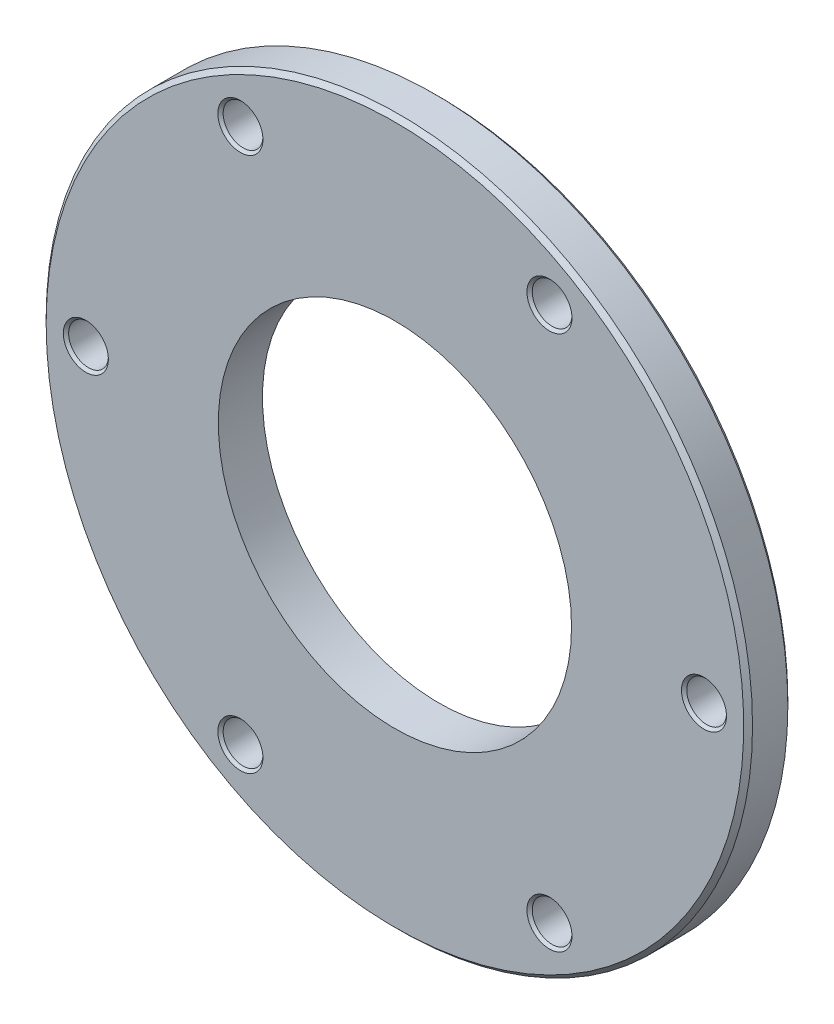
ISO-10303-21;
HEADER;
FILE_DESCRIPTION(('STEP AP214'),'2;1');
FILE_NAME('part.step','',(''),(''),'','','');
FILE_SCHEMA(('AUTOMOTIVE_DESIGN { 1 0 10303 214 1 1 1 1 }'));
ENDSEC;
DATA;
#1=APPLICATION_CONTEXT('core data for automotive mechanical design processes');
#2=APPLICATION_PROTOCOL_DEFINITION('international standard','automotive_design',2000,#1);
#3=PRODUCT_CONTEXT('',#1,'mechanical');
#4=PRODUCT('Part','Part','',(#3));
#5=PRODUCT_RELATED_PRODUCT_CATEGORY('part','',(#4));
#6=PRODUCT_DEFINITION_FORMATION('','',#4);
#7=PRODUCT_DEFINITION_CONTEXT('part definition',#1,'design');
#8=PRODUCT_DEFINITION('design','',#6,#7);
#9=PRODUCT_DEFINITION_SHAPE('','',#8);
#10=(LENGTH_UNIT() NAMED_UNIT(*) SI_UNIT(.MILLI.,.METRE.));
#11=(NAMED_UNIT(*) PLANE_ANGLE_UNIT() SI_UNIT($,.RADIAN.));
#12=(NAMED_UNIT(*) SI_UNIT($,.STERADIAN.) SOLID_ANGLE_UNIT());
#13=UNCERTAINTY_MEASURE_WITH_UNIT(LENGTH_MEASURE(1.E-05),#10,'distance_accuracy_value','');
#14=(GEOMETRIC_REPRESENTATION_CONTEXT(3) GLOBAL_UNCERTAINTY_ASSIGNED_CONTEXT((#13)) GLOBAL_UNIT_ASSIGNED_CONTEXT((#10,
#11,#12)) REPRESENTATION_CONTEXT('',''));
#15=CARTESIAN_POINT('',(0.,0.,0.));
#16=DIRECTION('',(0.,0.,1.));
#17=DIRECTION('',(1.,0.,0.));
#18=AXIS2_PLACEMENT_3D('',#15,#16,#17);
#19=CARTESIAN_POINT('',(17.5,-30.3108891324554,-2.50000000005457));
#20=DIRECTION('',(0.,0.,-1.));
#21=DIRECTION('',(-1.,0.,0.));
#22=AXIS2_PLACEMENT_3D('',#19,#20,#21);
#23=CONICAL_SURFACE('',#22,2.55000000009716,0.785398163368351);
#24=CARTESIAN_POINT('',(17.5,-30.3108891324554,-2.49999999999773));
#25=DIRECTION('',(0.,0.,-1.));
#26=DIRECTION('',(-1.,0.,0.));
#27=AXIS2_PLACEMENT_3D('',#24,#25,#26);
#28=CIRCLE('',#27,2.55000000004032);
#29=CARTESIAN_POINT('',(14.9499999999597,-30.3108891324554,-2.49999999999773));
#30=VERTEX_POINT('',#29);
#31=EDGE_CURVE('E16',#30,#30,#28,.F.);
#32=ORIENTED_EDGE('',*,*,#31,.F.);
#33=EDGE_LOOP('',(#32));
#34=FACE_BOUND('',#33,.T.);
#35=CARTESIAN_POINT('',(17.5,-30.3108891324554,-2.2));
#36=DIRECTION('',(0.,0.,1.));
#37=DIRECTION('',(1.,0.,0.));
#38=AXIS2_PLACEMENT_3D('',#35,#36,#37);
#39=CIRCLE('',#38,2.25);
#40=CARTESIAN_POINT('',(19.75,-30.3108891324554,-2.2));
#41=VERTEX_POINT('',#40);
#42=EDGE_CURVE('E28',#41,#41,#39,.T.);
#43=ORIENTED_EDGE('',*,*,#42,.T.);
#44=EDGE_LOOP('',(#43));
#45=FACE_BOUND('',#44,.T.);
#46=ADVANCED_FACE('F13',(#34,#45),#23,.F.);
#47=CARTESIAN_POINT('',(-17.5,-30.3108891324553,-2.49999999988404));
#48=DIRECTION('',(0.,0.,-1.));
#49=DIRECTION('',(-1.,0.,0.));
#50=AXIS2_PLACEMENT_3D('',#47,#48,#49);
#51=CONICAL_SURFACE('',#50,2.55000000000539,0.785398163461389);
#52=CARTESIAN_POINT('',(-17.5,-30.3108891324553,-2.49999999996169));
#53=DIRECTION('',(0.,0.,-1.));
#54=DIRECTION('',(-1.,0.,0.));
#55=AXIS2_PLACEMENT_3D('',#52,#53,#54);
#56=CIRCLE('',#55,2.55000000008304);
#57=CARTESIAN_POINT('',(-20.050000000083,-30.3108891324553,-2.49999999996169));
#58=VERTEX_POINT('',#57);
#59=EDGE_CURVE('E67',#58,#58,#56,.F.);
#60=ORIENTED_EDGE('',*,*,#59,.F.);
#61=EDGE_LOOP('',(#60));
#62=FACE_BOUND('',#61,.T.);
#63=CARTESIAN_POINT('',(-17.5,-30.3108891324553,-2.2));
#64=DIRECTION('',(0.,0.,1.));
#65=DIRECTION('',(1.,0.,0.));
#66=AXIS2_PLACEMENT_3D('',#63,#64,#65);
#67=CIRCLE('',#66,2.25);
#68=CARTESIAN_POINT('',(-15.25,-30.3108891324553,-2.2));
#69=VERTEX_POINT('',#68);
#70=EDGE_CURVE('E93',#69,#69,#67,.T.);
#71=ORIENTED_EDGE('',*,*,#70,.T.);
#72=EDGE_LOOP('',(#71));
#73=FACE_BOUND('',#72,.T.);
#74=ADVANCED_FACE('F190',(#62,#73),#51,.F.);
#75=CARTESIAN_POINT('',(-35.,0.,-2.49999999988404));
#76=DIRECTION('',(0.,0.,-1.));
#77=DIRECTION('',(-1.,0.,0.));
#78=AXIS2_PLACEMENT_3D('',#75,#76,#77);
#79=CONICAL_SURFACE('',#78,2.5499999998965,0.785398163397448);
#80=CARTESIAN_POINT('',(-35.,0.,-2.49999999994088));
#81=DIRECTION('',(0.,0.,-1.));
#82=DIRECTION('',(-1.,0.,0.));
#83=AXIS2_PLACEMENT_3D('',#80,#81,#82);
#84=CIRCLE('',#83,2.54999999995334);
#85=CARTESIAN_POINT('',(-37.5499999999533,0.,-2.49999999994088));
#86=VERTEX_POINT('',#85);
#87=EDGE_CURVE('E65',#86,#86,#84,.F.);
#88=ORIENTED_EDGE('',*,*,#87,.F.);
#89=EDGE_LOOP('',(#88));
#90=FACE_BOUND('',#89,.T.);
#91=CARTESIAN_POINT('',(-35.,0.,-2.2));
#92=DIRECTION('',(0.,0.,1.));
#93=DIRECTION('',(1.,0.,0.));
#94=AXIS2_PLACEMENT_3D('',#91,#92,#93);
#95=CIRCLE('',#94,2.25);
#96=CARTESIAN_POINT('',(-32.75,0.,-2.2));
#97=VERTEX_POINT('',#96);
#98=EDGE_CURVE('E91',#97,#97,#95,.T.);
#99=ORIENTED_EDGE('',*,*,#98,.T.);
#100=EDGE_LOOP('',(#99));
#101=FACE_BOUND('',#100,.T.);
#102=ADVANCED_FACE('F187',(#90,#101),#79,.F.);
#103=CARTESIAN_POINT('',(-17.5,30.3108891324554,-2.50000000005457));
#104=DIRECTION('',(0.,0.,-1.));
#105=DIRECTION('',(-1.,0.,0.));
#106=AXIS2_PLACEMENT_3D('',#103,#104,#105);
#107=CONICAL_SURFACE('',#106,2.55000000009716,0.785398163368351);
#108=CARTESIAN_POINT('',(-17.5,30.3108891324554,-2.49999999999773));
#109=DIRECTION('',(0.,0.,-1.));
#110=DIRECTION('',(-1.,0.,0.));
#111=AXIS2_PLACEMENT_3D('',#108,#109,#110);
#112=CIRCLE('',#111,2.55000000004032);
#113=CARTESIAN_POINT('',(-20.0500000000403,30.3108891324554,-2.49999999999773));
#114=VERTEX_POINT('',#113);
#115=EDGE_CURVE('E62',#114,#114,#112,.F.);
#116=ORIENTED_EDGE('',*,*,#115,.F.);
#117=EDGE_LOOP('',(#116));
#118=FACE_BOUND('',#117,.T.);
#119=CARTESIAN_POINT('',(-17.5,30.3108891324554,-2.2));
#120=DIRECTION('',(0.,0.,1.));
#121=DIRECTION('',(1.,0.,0.));
#122=AXIS2_PLACEMENT_3D('',#119,#120,#121);
#123=CIRCLE('',#122,2.25);
#124=CARTESIAN_POINT('',(-15.25,30.3108891324554,-2.2));
#125=VERTEX_POINT('',#124);
#126=EDGE_CURVE('E88',#125,#125,#123,.T.);
#127=ORIENTED_EDGE('',*,*,#126,.T.);
#128=EDGE_LOOP('',(#127));
#129=FACE_BOUND('',#128,.T.);
#130=ADVANCED_FACE('F189',(#118,#129),#107,.F.);
#131=CARTESIAN_POINT('',(17.5,30.3108891324554,-2.50000000005457));
#132=DIRECTION('',(0.,0.,-1.));
#133=DIRECTION('',(-1.,0.,0.));
#134=AXIS2_PLACEMENT_3D('',#131,#132,#133);
#135=CONICAL_SURFACE('',#134,2.55000000009716,0.785398163368351);
#136=CARTESIAN_POINT('',(17.5,30.3108891324554,-2.49999999999773));
#137=DIRECTION('',(0.,0.,-1.));
#138=DIRECTION('',(-1.,0.,0.));
#139=AXIS2_PLACEMENT_3D('',#136,#137,#138);
#140=CIRCLE('',#139,2.55000000004032);
#141=CARTESIAN_POINT('',(14.9499999999597,30.3108891324554,-2.49999999999773));
#142=VERTEX_POINT('',#141);
#143=EDGE_CURVE('E59',#142,#142,#140,.F.);
#144=ORIENTED_EDGE('',*,*,#143,.F.);
#145=EDGE_LOOP('',(#144));
#146=FACE_BOUND('',#145,.T.);
#147=CARTESIAN_POINT('',(17.5,30.3108891324554,-2.2));
#148=DIRECTION('',(0.,0.,1.));
#149=DIRECTION('',(1.,0.,0.));
#150=AXIS2_PLACEMENT_3D('',#147,#148,#149);
#151=CIRCLE('',#150,2.25);
#152=CARTESIAN_POINT('',(19.75,30.3108891324554,-2.2));
#153=VERTEX_POINT('',#152);
#154=EDGE_CURVE('E81',#153,#153,#151,.T.);
#155=ORIENTED_EDGE('',*,*,#154,.T.);
#156=EDGE_LOOP('',(#155));
#157=FACE_BOUND('',#156,.T.);
#158=ADVANCED_FACE('F197',(#146,#157),#135,.F.);
#159=CARTESIAN_POINT('',(35.,0.,-2.49999999988404));
#160=DIRECTION('',(0.,0.,-1.));
#161=DIRECTION('',(-1.,0.,0.));
#162=AXIS2_PLACEMENT_3D('',#159,#160,#161);
#163=CONICAL_SURFACE('',#162,2.5499999998965,0.785398163397448);
#164=CARTESIAN_POINT('',(35.,0.,-2.49999999994088));
#165=DIRECTION('',(0.,0.,-1.));
#166=DIRECTION('',(-1.,0.,0.));
#167=AXIS2_PLACEMENT_3D('',#164,#165,#166);
#168=CIRCLE('',#167,2.54999999995334);
#169=CARTESIAN_POINT('',(32.4500000000467,0.,-2.49999999994088));
#170=VERTEX_POINT('',#169);
#171=EDGE_CURVE('E56',#170,#170,#168,.F.);
#172=ORIENTED_EDGE('',*,*,#171,.F.);
#173=EDGE_LOOP('',(#172));
#174=FACE_BOUND('',#173,.T.);
#175=CARTESIAN_POINT('',(35.,0.,-2.2));
#176=DIRECTION('',(0.,0.,1.));
#177=DIRECTION('',(1.,0.,0.));
#178=AXIS2_PLACEMENT_3D('',#175,#176,#177);
#179=CIRCLE('',#178,2.25);
#180=CARTESIAN_POINT('',(37.25,0.,-2.2));
#181=VERTEX_POINT('',#180);
#182=EDGE_CURVE('E76',#181,#181,#179,.T.);
#183=ORIENTED_EDGE('',*,*,#182,.T.);
#184=EDGE_LOOP('',(#183));
#185=FACE_BOUND('',#184,.T.);
#186=ADVANCED_FACE('F115',(#174,#185),#163,.F.);
#187=CARTESIAN_POINT('',(0.,0.,-2.));
#188=DIRECTION('',(0.,0.,1.));
#189=DIRECTION('',(1.,0.,0.));
#190=AXIS2_PLACEMENT_3D('',#187,#188,#189);
#191=CONICAL_SURFACE('',#190,40.,0.785398163397447);
#192=CARTESIAN_POINT('',(0.,0.,-2.5));
#193=DIRECTION('',(0.,0.,1.));
#194=DIRECTION('',(1.,0.,0.));
#195=AXIS2_PLACEMENT_3D('',#192,#193,#194);
#196=CIRCLE('',#195,39.5);
#197=CARTESIAN_POINT('',(39.5,0.,-2.5));
#198=VERTEX_POINT('',#197);
#199=EDGE_CURVE('E52',#198,#198,#196,.F.);
#200=ORIENTED_EDGE('',*,*,#199,.F.);
#201=EDGE_LOOP('',(#200));
#202=FACE_BOUND('',#201,.T.);
#203=CARTESIAN_POINT('',(0.,0.,-2.));
#204=DIRECTION('',(0.,0.,1.));
#205=DIRECTION('',(1.,0.,0.));
#206=AXIS2_PLACEMENT_3D('',#203,#204,#205);
#207=CIRCLE('',#206,40.);
#208=CARTESIAN_POINT('',(40.,0.,-2.));
#209=VERTEX_POINT('',#208);
#210=EDGE_CURVE('E72',#209,#209,#207,.T.);
#211=ORIENTED_EDGE('',*,*,#210,.F.);
#212=EDGE_LOOP('',(#211));
#213=FACE_BOUND('',#212,.T.);
#214=ADVANCED_FACE('F104',(#202,#213),#191,.T.);
#215=CARTESIAN_POINT('',(17.5,-30.3108891324554,0.));
#216=DIRECTION('',(0.,0.,1.));
#217=DIRECTION('',(1.,0.,0.));
#218=AXIS2_PLACEMENT_3D('',#215,#216,#217);
#219=CYLINDRICAL_SURFACE('',#218,2.25);
#220=CARTESIAN_POINT('',(17.5,-30.3108891324554,2.20000000001619));
#221=DIRECTION('',(0.,0.,1.));
#222=DIRECTION('',(0.499999999989424,-0.866025403790545,0.));
#223=AXIS2_PLACEMENT_3D('',#220,#221,#222);
#224=CIRCLE('',#223,2.25000000007624);
#225=CARTESIAN_POINT('',(18.6250000000143,-32.2594462910502,2.20000000001619));
#226=VERTEX_POINT('',#225);
#227=EDGE_CURVE('E55',#226,#226,#224,.T.);
#228=ORIENTED_EDGE('',*,*,#227,.T.);
#229=EDGE_LOOP('',(#228));
#230=FACE_BOUND('',#229,.T.);
#231=ORIENTED_EDGE('',*,*,#42,.F.);
#232=EDGE_LOOP('',(#231));
#233=FACE_BOUND('',#232,.T.);
#234=ADVANCED_FACE('F101',(#230,#233),#219,.F.);
#235=CARTESIAN_POINT('',(-17.5,-30.3108891324553,0.));
#236=DIRECTION('',(0.,0.,1.));
#237=DIRECTION('',(1.,0.,0.));
#238=AXIS2_PLACEMENT_3D('',#235,#236,#237);
#239=CYLINDRICAL_SURFACE('',#238,2.25);
#240=CARTESIAN_POINT('',(-17.5,-30.3108891324553,2.1999999999025));
#241=DIRECTION('',(0.,0.,1.));
#242=DIRECTION('',(-0.49999999999087,-0.86602540378971,0.));
#243=AXIS2_PLACEMENT_3D('',#240,#241,#242);
#244=CIRCLE('',#243,2.25000000001289);
#245=CARTESIAN_POINT('',(-18.6249999999859,-32.2594462909933,2.1999999999025));
#246=VERTEX_POINT('',#245);
#247=EDGE_CURVE('E447',#246,#246,#244,.T.);
#248=ORIENTED_EDGE('',*,*,#247,.T.);
#249=EDGE_LOOP('',(#248));
#250=FACE_BOUND('',#249,.T.);
#251=ORIENTED_EDGE('',*,*,#70,.F.);
#252=EDGE_LOOP('',(#251));
#253=FACE_BOUND('',#252,.T.);
#254=ADVANCED_FACE('F103',(#250,#253),#239,.F.);
#255=CARTESIAN_POINT('',(-35.,0.,0.));
#256=DIRECTION('',(0.,0.,1.));
#257=DIRECTION('',(1.,0.,0.));
#258=AXIS2_PLACEMENT_3D('',#255,#256,#257);
#259=CYLINDRICAL_SURFACE('',#258,2.25);
#260=CARTESIAN_POINT('',(-35.,0.,2.19999999995935));
#261=DIRECTION('',(0.,0.,1.));
#262=DIRECTION('',(-1.,0.,0.));
#263=AXIS2_PLACEMENT_3D('',#260,#261,#262);
#264=CIRCLE('',#263,2.25000000002865);
#265=CARTESIAN_POINT('',(-37.2500000000286,0.,2.19999999995935));
#266=VERTEX_POINT('',#265);
#267=EDGE_CURVE('E184',#266,#266,#264,.T.);
#268=ORIENTED_EDGE('',*,*,#267,.T.);
#269=EDGE_LOOP('',(#268));
#270=FACE_BOUND('',#269,.T.);
#271=ORIENTED_EDGE('',*,*,#98,.F.);
#272=EDGE_LOOP('',(#271));
#273=FACE_BOUND('',#272,.T.);
#274=ADVANCED_FACE('F112',(#270,#273),#259,.F.);
#275=CARTESIAN_POINT('',(-17.5,30.3108891324554,0.));
#276=DIRECTION('',(0.,0.,1.));
#277=DIRECTION('',(1.,0.,0.));
#278=AXIS2_PLACEMENT_3D('',#275,#276,#277);
#279=CYLINDRICAL_SURFACE('',#278,2.25);
#280=CARTESIAN_POINT('',(-17.5,30.3108891324554,2.20000000001619));
#281=DIRECTION('',(0.,0.,1.));
#282=DIRECTION('',(-0.499999999989424,0.866025403790545,0.));
#283=AXIS2_PLACEMENT_3D('',#280,#281,#282);
#284=CIRCLE('',#283,2.25000000007624);
#285=CARTESIAN_POINT('',(-18.6250000000143,32.2594462910502,2.20000000001619));
#286=VERTEX_POINT('',#285);
#287=EDGE_CURVE('E446',#286,#286,#284,.T.);
#288=ORIENTED_EDGE('',*,*,#287,.T.);
#289=EDGE_LOOP('',(#288));
#290=FACE_BOUND('',#289,.T.);
#291=ORIENTED_EDGE('',*,*,#126,.F.);
#292=EDGE_LOOP('',(#291));
#293=FACE_BOUND('',#292,.T.);
#294=ADVANCED_FACE('F172',(#290,#293),#279,.F.);
#295=CARTESIAN_POINT('',(17.5,30.3108891324554,0.));
#296=DIRECTION('',(0.,0.,1.));
#297=DIRECTION('',(1.,0.,0.));
#298=AXIS2_PLACEMENT_3D('',#295,#296,#297);
#299=CYLINDRICAL_SURFACE('',#298,2.25);
#300=CARTESIAN_POINT('',(17.5,30.3108891324554,2.20000000001619));
#301=DIRECTION('',(0.,0.,1.));
#302=DIRECTION('',(0.499999999989424,0.866025403790545,0.));
#303=AXIS2_PLACEMENT_3D('',#300,#301,#302);
#304=CIRCLE('',#303,2.25000000007624);
#305=CARTESIAN_POINT('',(18.6250000000143,32.2594462910502,2.20000000001619));
#306=VERTEX_POINT('',#305);
#307=EDGE_CURVE('E450',#306,#306,#304,.T.);
#308=ORIENTED_EDGE('',*,*,#307,.T.);
#309=EDGE_LOOP('',(#308));
#310=FACE_BOUND('',#309,.T.);
#311=ORIENTED_EDGE('',*,*,#154,.F.);
#312=EDGE_LOOP('',(#311));
#313=FACE_BOUND('',#312,.T.);
#314=ADVANCED_FACE('F168',(#310,#313),#299,.F.);
#315=CARTESIAN_POINT('',(35.,0.,0.));
#316=DIRECTION('',(0.,0.,1.));
#317=DIRECTION('',(1.,0.,0.));
#318=AXIS2_PLACEMENT_3D('',#315,#316,#317);
#319=CYLINDRICAL_SURFACE('',#318,2.25);
#320=CARTESIAN_POINT('',(35.,0.,2.19999999995935));
#321=DIRECTION('',(0.,0.,1.));
#322=DIRECTION('',(1.,0.,0.));
#323=AXIS2_PLACEMENT_3D('',#320,#321,#322);
#324=CIRCLE('',#323,2.25000000002865);
#325=CARTESIAN_POINT('',(37.2500000000286,0.,2.19999999995935));
#326=VERTEX_POINT('',#325);
#327=EDGE_CURVE('E456',#326,#326,#324,.T.);
#328=ORIENTED_EDGE('',*,*,#327,.T.);
#329=EDGE_LOOP('',(#328));
#330=FACE_BOUND('',#329,.T.);
#331=ORIENTED_EDGE('',*,*,#182,.F.);
#332=EDGE_LOOP('',(#331));
#333=FACE_BOUND('',#332,.T.);
#334=ADVANCED_FACE('F165',(#330,#333),#319,.F.);
#335=CARTESIAN_POINT('',(0.,0.,0.));
#336=DIRECTION('',(0.,0.,1.));
#337=DIRECTION('',(1.,0.,0.));
#338=AXIS2_PLACEMENT_3D('',#335,#336,#337);
#339=CYLINDRICAL_SURFACE('',#338,40.);
#340=ORIENTED_EDGE('',*,*,#210,.T.);
#341=EDGE_LOOP('',(#340));
#342=FACE_BOUND('',#341,.T.);
#343=CARTESIAN_POINT('',(0.,0.,2.));
#344=DIRECTION('',(0.,0.,-1.));
#345=DIRECTION('',(1.,0.,0.));
#346=AXIS2_PLACEMENT_3D('',#343,#344,#345);
#347=CIRCLE('',#346,40.);
#348=CARTESIAN_POINT('',(40.,0.,2.));
#349=VERTEX_POINT('',#348);
#350=EDGE_CURVE('E51',#349,#349,#347,.F.);
#351=ORIENTED_EDGE('',*,*,#350,.F.);
#352=EDGE_LOOP('',(#351));
#353=FACE_BOUND('',#352,.T.);
#354=ADVANCED_FACE('F161',(#342,#353),#339,.T.);
#355=CARTESIAN_POINT('',(29.75,0.,-2.5));
#356=DIRECTION('',(0.,0.,-1.));
#357=DIRECTION('',(-1.,0.,0.));
#358=AXIS2_PLACEMENT_3D('',#355,#356,#357);
#359=PLANE('',#358);
#360=ORIENTED_EDGE('',*,*,#199,.T.);
#361=EDGE_LOOP('',(#360));
#362=FACE_BOUND('',#361,.T.);
#363=CARTESIAN_POINT('',(0.,0.,-2.5));
#364=DIRECTION('',(0.,0.,1.));
#365=DIRECTION('',(1.,0.,0.));
#366=AXIS2_PLACEMENT_3D('',#363,#364,#365);
#367=CIRCLE('',#366,20.);
#368=CARTESIAN_POINT('',(20.,0.,-2.5));
#369=VERTEX_POINT('',#368);
#370=EDGE_CURVE('E48',#369,#369,#367,.T.);
#371=ORIENTED_EDGE('',*,*,#370,.T.);
#372=EDGE_LOOP('',(#371));
#373=FACE_BOUND('',#372,.T.);
#374=ORIENTED_EDGE('',*,*,#171,.T.);
#375=EDGE_LOOP('',(#374));
#376=FACE_BOUND('',#375,.T.);
#377=ORIENTED_EDGE('',*,*,#143,.T.);
#378=EDGE_LOOP('',(#377));
#379=FACE_BOUND('',#378,.T.);
#380=ORIENTED_EDGE('',*,*,#115,.T.);
#381=EDGE_LOOP('',(#380));
#382=FACE_BOUND('',#381,.T.);
#383=ORIENTED_EDGE('',*,*,#87,.T.);
#384=EDGE_LOOP('',(#383));
#385=FACE_BOUND('',#384,.T.);
#386=ORIENTED_EDGE('',*,*,#59,.T.);
#387=EDGE_LOOP('',(#386));
#388=FACE_BOUND('',#387,.T.);
#389=ORIENTED_EDGE('',*,*,#31,.T.);
#390=EDGE_LOOP('',(#389));
#391=FACE_BOUND('',#390,.T.);
#392=ADVANCED_FACE('F157',(#362,#373,#376,#379,#382,#385,#388,#391),#359,.T.);
#393=CARTESIAN_POINT('',(17.5,-30.3108891324554,2.50000000005457));
#394=DIRECTION('',(0.,0.,1.));
#395=DIRECTION('',(1.,0.,0.));
#396=AXIS2_PLACEMENT_3D('',#393,#394,#395);
#397=CONICAL_SURFACE('',#396,2.55000000009716,0.785398163368351);
#398=CARTESIAN_POINT('',(17.5,-30.3108891324554,2.49999999999773));
#399=DIRECTION('',(0.,0.,1.));
#400=DIRECTION('',(1.,0.,0.));
#401=AXIS2_PLACEMENT_3D('',#398,#399,#400);
#402=CIRCLE('',#401,2.55000000004032);
#403=CARTESIAN_POINT('',(20.0500000000403,-30.3108891324554,2.49999999999773));
#404=VERTEX_POINT('',#403);
#405=EDGE_CURVE('E45',#404,#404,#402,.F.);
#406=ORIENTED_EDGE('',*,*,#405,.F.);
#407=EDGE_LOOP('',(#406));
#408=FACE_BOUND('',#407,.T.);
#409=ORIENTED_EDGE('',*,*,#227,.F.);
#410=EDGE_LOOP('',(#409));
#411=FACE_BOUND('',#410,.T.);
#412=ADVANCED_FACE('F153',(#408,#411),#397,.F.);
#413=CARTESIAN_POINT('',(-17.5,-30.3108891324553,2.49999999988404));
#414=DIRECTION('',(0.,0.,1.));
#415=DIRECTION('',(1.,0.,0.));
#416=AXIS2_PLACEMENT_3D('',#413,#414,#415);
#417=CONICAL_SURFACE('',#416,2.55000000000539,0.785398163461389);
#418=CARTESIAN_POINT('',(-17.5,-30.3108891324553,2.49999999994662));
#419=DIRECTION('',(0.,0.,1.));
#420=DIRECTION('',(1.,0.,0.));
#421=AXIS2_PLACEMENT_3D('',#418,#419,#420);
#422=CIRCLE('',#421,2.55000000006797);
#423=CARTESIAN_POINT('',(-14.949999999932,-30.3108891324553,2.49999999994662));
#424=VERTEX_POINT('',#423);
#425=EDGE_CURVE('E42',#424,#424,#422,.F.);
#426=ORIENTED_EDGE('',*,*,#425,.F.);
#427=EDGE_LOOP('',(#426));
#428=FACE_BOUND('',#427,.T.);
#429=ORIENTED_EDGE('',*,*,#247,.F.);
#430=EDGE_LOOP('',(#429));
#431=FACE_BOUND('',#430,.T.);
#432=ADVANCED_FACE('F149',(#428,#431),#417,.F.);
#433=CARTESIAN_POINT('',(-35.,0.,2.49999999988404));
#434=DIRECTION('',(0.,0.,1.));
#435=DIRECTION('',(1.,0.,0.));
#436=AXIS2_PLACEMENT_3D('',#433,#434,#435);
#437=CONICAL_SURFACE('',#436,2.5499999998965,0.785398163397448);
#438=CARTESIAN_POINT('',(-35.,0.,2.49999999994088));
#439=DIRECTION('',(0.,0.,1.));
#440=DIRECTION('',(1.,0.,0.));
#441=AXIS2_PLACEMENT_3D('',#438,#439,#440);
#442=CIRCLE('',#441,2.54999999995334);
#443=CARTESIAN_POINT('',(-32.4500000000467,0.,2.49999999994088));
#444=VERTEX_POINT('',#443);
#445=EDGE_CURVE('E39',#444,#444,#442,.F.);
#446=ORIENTED_EDGE('',*,*,#445,.F.);
#447=EDGE_LOOP('',(#446));
#448=FACE_BOUND('',#447,.T.);
#449=ORIENTED_EDGE('',*,*,#267,.F.);
#450=EDGE_LOOP('',(#449));
#451=FACE_BOUND('',#450,.T.);
#452=ADVANCED_FACE('F145',(#448,#451),#437,.F.);
#453=CARTESIAN_POINT('',(-17.5,30.3108891324554,2.50000000005457));
#454=DIRECTION('',(0.,0.,1.));
#455=DIRECTION('',(1.,0.,0.));
#456=AXIS2_PLACEMENT_3D('',#453,#454,#455);
#457=CONICAL_SURFACE('',#456,2.55000000009716,0.785398163368351);
#458=CARTESIAN_POINT('',(-17.5,30.3108891324554,2.49999999999773));
#459=DIRECTION('',(0.,0.,1.));
#460=DIRECTION('',(1.,0.,0.));
#461=AXIS2_PLACEMENT_3D('',#458,#459,#460);
#462=CIRCLE('',#461,2.55000000004032);
#463=CARTESIAN_POINT('',(-14.9499999999597,30.3108891324554,2.49999999999773));
#464=VERTEX_POINT('',#463);
#465=EDGE_CURVE('E36',#464,#464,#462,.F.);
#466=ORIENTED_EDGE('',*,*,#465,.F.);
#467=EDGE_LOOP('',(#466));
#468=FACE_BOUND('',#467,.T.);
#469=ORIENTED_EDGE('',*,*,#287,.F.);
#470=EDGE_LOOP('',(#469));
#471=FACE_BOUND('',#470,.T.);
#472=ADVANCED_FACE('F141',(#468,#471),#457,.F.);
#473=CARTESIAN_POINT('',(17.5,30.3108891324554,2.50000000005457));
#474=DIRECTION('',(0.,0.,1.));
#475=DIRECTION('',(1.,0.,0.));
#476=AXIS2_PLACEMENT_3D('',#473,#474,#475);
#477=CONICAL_SURFACE('',#476,2.55000000009716,0.785398163368351);
#478=CARTESIAN_POINT('',(17.5,30.3108891324554,2.49999999999773));
#479=DIRECTION('',(0.,0.,1.));
#480=DIRECTION('',(1.,0.,0.));
#481=AXIS2_PLACEMENT_3D('',#478,#479,#480);
#482=CIRCLE('',#481,2.55000000004032);
#483=CARTESIAN_POINT('',(20.0500000000403,30.3108891324554,2.49999999999773));
#484=VERTEX_POINT('',#483);
#485=EDGE_CURVE('E33',#484,#484,#482,.F.);
#486=ORIENTED_EDGE('',*,*,#485,.F.);
#487=EDGE_LOOP('',(#486));
#488=FACE_BOUND('',#487,.T.);
#489=ORIENTED_EDGE('',*,*,#307,.F.);
#490=EDGE_LOOP('',(#489));
#491=FACE_BOUND('',#490,.T.);
#492=ADVANCED_FACE('F137',(#488,#491),#477,.F.);
#493=CARTESIAN_POINT('',(35.,0.,2.49999999988404));
#494=DIRECTION('',(0.,0.,1.));
#495=DIRECTION('',(1.,0.,0.));
#496=AXIS2_PLACEMENT_3D('',#493,#494,#495);
#497=CONICAL_SURFACE('',#496,2.5499999998965,0.785398163397448);
#498=CARTESIAN_POINT('',(35.,0.,2.49999999994088));
#499=DIRECTION('',(0.,0.,1.));
#500=DIRECTION('',(1.,0.,0.));
#501=AXIS2_PLACEMENT_3D('',#498,#499,#500);
#502=CIRCLE('',#501,2.54999999995334);
#503=CARTESIAN_POINT('',(37.5499999999533,0.,2.49999999994088));
#504=VERTEX_POINT('',#503);
#505=EDGE_CURVE('E25',#504,#504,#502,.F.);
#506=ORIENTED_EDGE('',*,*,#505,.F.);
#507=EDGE_LOOP('',(#506));
#508=FACE_BOUND('',#507,.T.);
#509=ORIENTED_EDGE('',*,*,#327,.F.);
#510=EDGE_LOOP('',(#509));
#511=FACE_BOUND('',#510,.T.);
#512=ADVANCED_FACE('F133',(#508,#511),#497,.F.);
#513=CARTESIAN_POINT('',(0.,0.,2.));
#514=DIRECTION('',(0.,0.,-1.));
#515=DIRECTION('',(-1.,0.,0.));
#516=AXIS2_PLACEMENT_3D('',#513,#514,#515);
#517=CONICAL_SURFACE('',#516,40.,0.785398163397447);
#518=ORIENTED_EDGE('',*,*,#350,.T.);
#519=EDGE_LOOP('',(#518));
#520=FACE_BOUND('',#519,.T.);
#521=CARTESIAN_POINT('',(0.,0.,2.5));
#522=DIRECTION('',(0.,0.,-1.));
#523=DIRECTION('',(-1.,0.,0.));
#524=AXIS2_PLACEMENT_3D('',#521,#522,#523);
#525=CIRCLE('',#524,39.5);
#526=CARTESIAN_POINT('',(-39.5,0.,2.5));
#527=VERTEX_POINT('',#526);
#528=EDGE_CURVE('E20',#527,#527,#525,.F.);
#529=ORIENTED_EDGE('',*,*,#528,.F.);
#530=EDGE_LOOP('',(#529));
#531=FACE_BOUND('',#530,.T.);
#532=ADVANCED_FACE('F126',(#520,#531),#517,.T.);
#533=CARTESIAN_POINT('',(0.,0.,0.));
#534=DIRECTION('',(0.,0.,1.));
#535=DIRECTION('',(1.,0.,0.));
#536=AXIS2_PLACEMENT_3D('',#533,#534,#535);
#537=CYLINDRICAL_SURFACE('',#536,20.);
#538=CARTESIAN_POINT('',(0.,0.,2.5));
#539=DIRECTION('',(0.,0.,1.));
#540=DIRECTION('',(1.,0.,0.));
#541=AXIS2_PLACEMENT_3D('',#538,#539,#540);
#542=CIRCLE('',#541,20.);
#543=CARTESIAN_POINT('',(20.,0.,2.5));
#544=VERTEX_POINT('',#543);
#545=EDGE_CURVE('E9',#544,#544,#542,.F.);
#546=ORIENTED_EDGE('',*,*,#545,.F.);
#547=EDGE_LOOP('',(#546));
#548=FACE_BOUND('',#547,.T.);
#549=ORIENTED_EDGE('',*,*,#370,.F.);
#550=EDGE_LOOP('',(#549));
#551=FACE_BOUND('',#550,.T.);
#552=ADVANCED_FACE('F121',(#548,#551),#537,.F.);
#553=CARTESIAN_POINT('',(29.75,0.,2.5));
#554=DIRECTION('',(0.,0.,1.));
#555=DIRECTION('',(1.,0.,0.));
#556=AXIS2_PLACEMENT_3D('',#553,#554,#555);
#557=PLANE('',#556);
#558=ORIENTED_EDGE('',*,*,#545,.T.);
#559=EDGE_LOOP('',(#558));
#560=FACE_BOUND('',#559,.T.);
#561=ORIENTED_EDGE('',*,*,#528,.T.);
#562=EDGE_LOOP('',(#561));
#563=FACE_BOUND('',#562,.T.);
#564=ORIENTED_EDGE('',*,*,#505,.T.);
#565=EDGE_LOOP('',(#564));
#566=FACE_BOUND('',#565,.T.);
#567=ORIENTED_EDGE('',*,*,#485,.T.);
#568=EDGE_LOOP('',(#567));
#569=FACE_BOUND('',#568,.T.);
#570=ORIENTED_EDGE('',*,*,#465,.T.);
#571=EDGE_LOOP('',(#570));
#572=FACE_BOUND('',#571,.T.);
#573=ORIENTED_EDGE('',*,*,#445,.T.);
#574=EDGE_LOOP('',(#573));
#575=FACE_BOUND('',#574,.T.);
#576=ORIENTED_EDGE('',*,*,#425,.T.);
#577=EDGE_LOOP('',(#576));
#578=FACE_BOUND('',#577,.T.);
#579=ORIENTED_EDGE('',*,*,#405,.T.);
#580=EDGE_LOOP('',(#579));
#581=FACE_BOUND('',#580,.T.);
#582=ADVANCED_FACE('F119',(#560,#563,#566,#569,#572,#575,#578,#581),#557,.T.);
#583=CLOSED_SHELL('',(#46,#74,#102,#130,#158,#186,#214,#234,#254,#274,#294,#314,#334,#354,#392,
#412,#432,#452,#472,#492,#512,#532,#552,#582));
#584=MANIFOLD_SOLID_BREP('B1',#583);
#585=ADVANCED_BREP_SHAPE_REPRESENTATION('',(#18,#584),#14);
#586=SHAPE_DEFINITION_REPRESENTATION(#9,#585);
ENDSEC;
END-ISO-10303-21;
